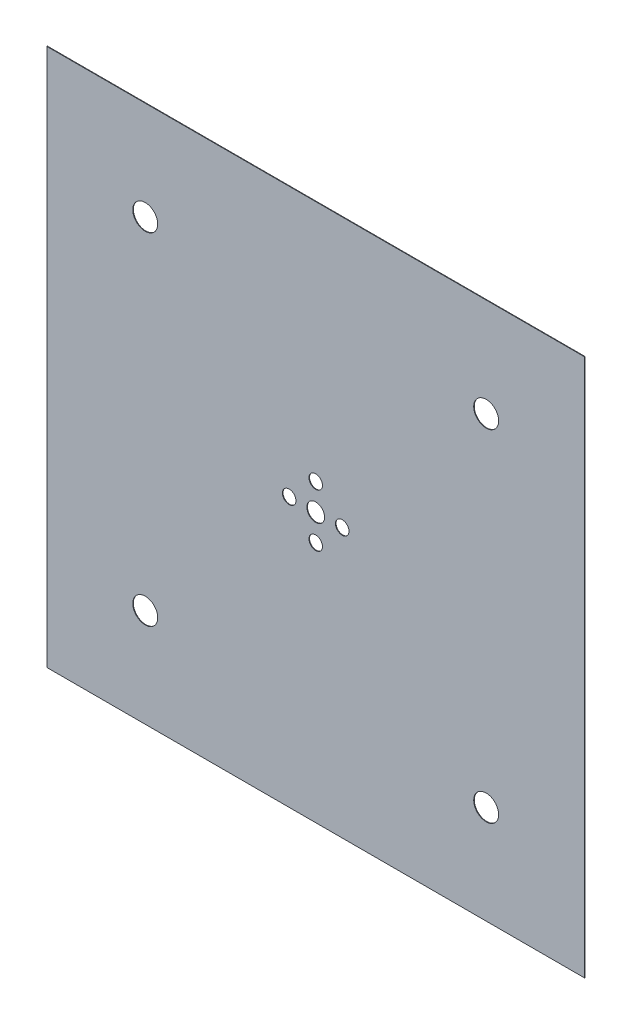
ISO-10303-21;
HEADER;
FILE_DESCRIPTION(('STEP AP214'),'2;1');
FILE_NAME('part.step','',(''),(''),'','','');
FILE_SCHEMA(('AUTOMOTIVE_DESIGN { 1 0 10303 214 1 1 1 1 }'));
ENDSEC;
DATA;
#1=APPLICATION_CONTEXT('core data for automotive mechanical design processes');
#2=APPLICATION_PROTOCOL_DEFINITION('international standard','automotive_design',2000,#1);
#3=PRODUCT_CONTEXT('',#1,'mechanical');
#4=PRODUCT('Part','Part','',(#3));
#5=PRODUCT_RELATED_PRODUCT_CATEGORY('part','',(#4));
#6=PRODUCT_DEFINITION_FORMATION('','',#4);
#7=PRODUCT_DEFINITION_CONTEXT('part definition',#1,'design');
#8=PRODUCT_DEFINITION('design','',#6,#7);
#9=PRODUCT_DEFINITION_SHAPE('','',#8);
#10=(LENGTH_UNIT() NAMED_UNIT(*) SI_UNIT(.MILLI.,.METRE.));
#11=(NAMED_UNIT(*) PLANE_ANGLE_UNIT() SI_UNIT($,.RADIAN.));
#12=(NAMED_UNIT(*) SI_UNIT($,.STERADIAN.) SOLID_ANGLE_UNIT());
#13=UNCERTAINTY_MEASURE_WITH_UNIT(LENGTH_MEASURE(1.E-05),#10,'distance_accuracy_value','');
#14=(GEOMETRIC_REPRESENTATION_CONTEXT(3) GLOBAL_UNCERTAINTY_ASSIGNED_CONTEXT((#13)) GLOBAL_UNIT_ASSIGNED_CONTEXT((#10,
#11,#12)) REPRESENTATION_CONTEXT('',''));
#15=CARTESIAN_POINT('',(0.,0.,0.));
#16=DIRECTION('',(0.,0.,1.));
#17=DIRECTION('',(1.,0.,0.));
#18=AXIS2_PLACEMENT_3D('',#15,#16,#17);
#19=CARTESIAN_POINT('',(0.,0.,3.));
#20=DIRECTION('',(0.,0.,1.));
#21=DIRECTION('',(1.,0.,0.));
#22=AXIS2_PLACEMENT_3D('',#19,#20,#21);
#23=PLANE('',#22);
#24=CARTESIAN_POINT('',(140.000000000001,-1.66533453693773E-12,3.));
#25=DIRECTION('',(0.,0.,1.));
#26=DIRECTION('',(1.,0.,0.));
#27=AXIS2_PLACEMENT_3D('',#24,#25,#26);
#28=CIRCLE('',#27,35.6374999999993);
#29=CARTESIAN_POINT('',(175.637500000001,-1.66533453693773E-12,3.));
#30=VERTEX_POINT('',#29);
#31=EDGE_CURVE('E157',#30,#30,#28,.T.);
#32=ORIENTED_EDGE('',*,*,#31,.F.);
#33=EDGE_LOOP('',(#32));
#34=FACE_BOUND('',#33,.T.);
#35=CARTESIAN_POINT('',(900.000000000001,900.,3.));
#36=DIRECTION('',(0.,0.,1.));
#37=DIRECTION('',(1.,0.,0.));
#38=AXIS2_PLACEMENT_3D('',#35,#36,#37);
#39=CIRCLE('',#38,65.8);
#40=CARTESIAN_POINT('',(965.800000000001,900.,3.));
#41=VERTEX_POINT('',#40);
#42=EDGE_CURVE('E145',#41,#41,#39,.T.);
#43=ORIENTED_EDGE('',*,*,#42,.F.);
#44=EDGE_LOOP('',(#43));
#45=FACE_BOUND('',#44,.T.);
#46=CARTESIAN_POINT('',(900.000000000001,-900.,3.));
#47=DIRECTION('',(0.,0.,1.));
#48=DIRECTION('',(-1.,0.,0.));
#49=AXIS2_PLACEMENT_3D('',#46,#47,#48);
#50=CIRCLE('',#49,65.8);
#51=CARTESIAN_POINT('',(834.200000000001,-900.,3.));
#52=VERTEX_POINT('',#51);
#53=EDGE_CURVE('E133',#52,#52,#50,.T.);
#54=ORIENTED_EDGE('',*,*,#53,.F.);
#55=EDGE_LOOP('',(#54));
#56=FACE_BOUND('',#55,.T.);
#57=CARTESIAN_POINT('',(1.56754790290861E-13,140.,3.));
#58=DIRECTION('',(0.,0.,1.));
#59=DIRECTION('',(1.,0.,0.));
#60=AXIS2_PLACEMENT_3D('',#57,#58,#59);
#61=CIRCLE('',#60,35.6375);
#62=CARTESIAN_POINT('',(35.6375000000002,140.,3.));
#63=VERTEX_POINT('',#62);
#64=EDGE_CURVE('E121',#63,#63,#61,.T.);
#65=ORIENTED_EDGE('',*,*,#64,.F.);
#66=EDGE_LOOP('',(#65));
#67=FACE_BOUND('',#66,.T.);
#68=DIRECTION('',(0.,1.,0.));
#69=VECTOR('',#68,1.);
#70=CARTESIAN_POINT('',(1420.,1420.,3.));
#71=LINE('',#70,#69);
#72=CARTESIAN_POINT('',(1420.,-1420.,3.));
#73=VERTEX_POINT('',#72);
#74=CARTESIAN_POINT('',(1420.,1420.,3.));
#75=VERTEX_POINT('',#74);
#76=EDGE_CURVE('E91',#73,#75,#71,.T.);
#77=ORIENTED_EDGE('',*,*,#76,.T.);
#78=DIRECTION('',(-1.,0.,0.));
#79=VECTOR('',#78,1.);
#80=CARTESIAN_POINT('',(-1420.,1420.,3.));
#81=LINE('',#80,#79);
#82=CARTESIAN_POINT('',(-1420.,1420.,3.));
#83=VERTEX_POINT('',#82);
#84=EDGE_CURVE('E86',#75,#83,#81,.T.);
#85=ORIENTED_EDGE('',*,*,#84,.T.);
#86=DIRECTION('',(0.,-1.,0.));
#87=VECTOR('',#86,1.);
#88=CARTESIAN_POINT('',(-1420.,1420.,3.));
#89=LINE('',#88,#87);
#90=CARTESIAN_POINT('',(-1420.,-1420.,3.));
#91=VERTEX_POINT('',#90);
#92=EDGE_CURVE('E89',#83,#91,#89,.T.);
#93=ORIENTED_EDGE('',*,*,#92,.T.);
#94=DIRECTION('',(1.,0.,0.));
#95=VECTOR('',#94,1.);
#96=CARTESIAN_POINT('',(-1420.,-1420.,3.));
#97=LINE('',#96,#95);
#98=EDGE_CURVE('E56',#91,#73,#97,.T.);
#99=ORIENTED_EDGE('',*,*,#98,.T.);
#100=EDGE_LOOP('',(#77,#85,#93,#99));
#101=FACE_BOUND('',#100,.T.);
#102=CARTESIAN_POINT('',(6.66133814775094E-13,-8.88178419700125E-13,3.));
#103=DIRECTION('',(0.,0.,1.));
#104=DIRECTION('',(1.,0.,0.));
#105=AXIS2_PLACEMENT_3D('',#102,#103,#104);
#106=CIRCLE('',#105,46.75);
#107=CARTESIAN_POINT('',(46.7500000000007,-8.88178419700125E-13,3.));
#108=VERTEX_POINT('',#107);
#109=EDGE_CURVE('E106',#108,#108,#106,.T.);
#110=ORIENTED_EDGE('',*,*,#109,.F.);
#111=EDGE_LOOP('',(#110));
#112=FACE_BOUND('',#111,.T.);
#113=CARTESIAN_POINT('',(-900.,900.,3.));
#114=DIRECTION('',(0.,0.,1.));
#115=DIRECTION('',(1.,0.,0.));
#116=AXIS2_PLACEMENT_3D('',#113,#114,#115);
#117=CIRCLE('',#116,65.8);
#118=CARTESIAN_POINT('',(-834.2,900.,3.));
#119=VERTEX_POINT('',#118);
#120=EDGE_CURVE('E127',#119,#119,#117,.T.);
#121=ORIENTED_EDGE('',*,*,#120,.F.);
#122=EDGE_LOOP('',(#121));
#123=FACE_BOUND('',#122,.T.);
#124=CARTESIAN_POINT('',(1.56754790290861E-13,-140.,3.));
#125=DIRECTION('',(0.,0.,1.));
#126=DIRECTION('',(-1.,0.,0.));
#127=AXIS2_PLACEMENT_3D('',#124,#125,#126);
#128=CIRCLE('',#127,35.6375);
#129=CARTESIAN_POINT('',(-35.6374999999998,-140.,3.));
#130=VERTEX_POINT('',#129);
#131=EDGE_CURVE('E139',#130,#130,#128,.T.);
#132=ORIENTED_EDGE('',*,*,#131,.F.);
#133=EDGE_LOOP('',(#132));
#134=FACE_BOUND('',#133,.T.);
#135=CARTESIAN_POINT('',(-900.,-900.000000000001,3.));
#136=DIRECTION('',(0.,0.,1.));
#137=DIRECTION('',(-1.,0.,0.));
#138=AXIS2_PLACEMENT_3D('',#135,#136,#137);
#139=CIRCLE('',#138,65.8);
#140=CARTESIAN_POINT('',(-965.8,-900.000000000001,3.));
#141=VERTEX_POINT('',#140);
#142=EDGE_CURVE('E151',#141,#141,#139,.T.);
#143=ORIENTED_EDGE('',*,*,#142,.F.);
#144=EDGE_LOOP('',(#143));
#145=FACE_BOUND('',#144,.T.);
#146=CARTESIAN_POINT('',(-140.,-9.99200722162641E-13,3.));
#147=DIRECTION('',(0.,0.,1.));
#148=DIRECTION('',(-1.,0.,0.));
#149=AXIS2_PLACEMENT_3D('',#146,#147,#148);
#150=CIRCLE('',#149,35.6375000000002);
#151=CARTESIAN_POINT('',(-175.6375,-9.99200722162641E-13,3.));
#152=VERTEX_POINT('',#151);
#153=EDGE_CURVE('E163',#152,#152,#150,.T.);
#154=ORIENTED_EDGE('',*,*,#153,.F.);
#155=EDGE_LOOP('',(#154));
#156=FACE_BOUND('',#155,.T.);
#157=ADVANCED_FACE('F39',(#34,#45,#56,#67,#101,#112,#123,#134,#145,#156),#23,.T.);
#158=CARTESIAN_POINT('',(0.,0.,0.));
#159=DIRECTION('',(0.,0.,1.));
#160=DIRECTION('',(1.,0.,0.));
#161=AXIS2_PLACEMENT_3D('',#158,#159,#160);
#162=PLANE('',#161);
#163=DIRECTION('',(0.,1.,0.));
#164=VECTOR('',#163,1.);
#165=CARTESIAN_POINT('',(1420.,1420.,0.));
#166=LINE('',#165,#164);
#167=CARTESIAN_POINT('',(1420.,-1420.,0.));
#168=VERTEX_POINT('',#167);
#169=CARTESIAN_POINT('',(1420.,1420.,0.));
#170=VERTEX_POINT('',#169);
#171=EDGE_CURVE('E103',#168,#170,#166,.T.);
#172=ORIENTED_EDGE('',*,*,#171,.F.);
#173=DIRECTION('',(1.,0.,0.));
#174=VECTOR('',#173,1.);
#175=CARTESIAN_POINT('',(-1420.,-1420.,0.));
#176=LINE('',#175,#174);
#177=CARTESIAN_POINT('',(-1420.,-1420.,0.));
#178=VERTEX_POINT('',#177);
#179=EDGE_CURVE('E79',#178,#168,#176,.T.);
#180=ORIENTED_EDGE('',*,*,#179,.F.);
#181=DIRECTION('',(0.,-1.,0.));
#182=VECTOR('',#181,1.);
#183=CARTESIAN_POINT('',(-1420.,1420.,0.));
#184=LINE('',#183,#182);
#185=CARTESIAN_POINT('',(-1420.,1420.,0.));
#186=VERTEX_POINT('',#185);
#187=EDGE_CURVE('E73',#186,#178,#184,.T.);
#188=ORIENTED_EDGE('',*,*,#187,.F.);
#189=DIRECTION('',(-1.,0.,0.));
#190=VECTOR('',#189,1.);
#191=CARTESIAN_POINT('',(-1420.,1420.,0.));
#192=LINE('',#191,#190);
#193=EDGE_CURVE('E95',#170,#186,#192,.T.);
#194=ORIENTED_EDGE('',*,*,#193,.F.);
#195=EDGE_LOOP('',(#172,#180,#188,#194));
#196=FACE_BOUND('',#195,.T.);
#197=CARTESIAN_POINT('',(6.66133814775094E-13,-8.88178419700125E-13,0.));
#198=DIRECTION('',(0.,0.,1.));
#199=DIRECTION('',(1.,0.,0.));
#200=AXIS2_PLACEMENT_3D('',#197,#198,#199);
#201=CIRCLE('',#200,46.75);
#202=CARTESIAN_POINT('',(46.7500000000007,-8.88178419700125E-13,0.));
#203=VERTEX_POINT('',#202);
#204=EDGE_CURVE('E118',#203,#203,#201,.T.);
#205=ORIENTED_EDGE('',*,*,#204,.T.);
#206=EDGE_LOOP('',(#205));
#207=FACE_BOUND('',#206,.T.);
#208=CARTESIAN_POINT('',(1.56754790290861E-13,140.,0.));
#209=DIRECTION('',(0.,0.,1.));
#210=DIRECTION('',(1.,0.,0.));
#211=AXIS2_PLACEMENT_3D('',#208,#209,#210);
#212=CIRCLE('',#211,35.6375);
#213=CARTESIAN_POINT('',(35.6375000000002,140.,0.));
#214=VERTEX_POINT('',#213);
#215=EDGE_CURVE('E124',#214,#214,#212,.T.);
#216=ORIENTED_EDGE('',*,*,#215,.T.);
#217=EDGE_LOOP('',(#216));
#218=FACE_BOUND('',#217,.T.);
#219=CARTESIAN_POINT('',(-900.,900.,0.));
#220=DIRECTION('',(0.,0.,1.));
#221=DIRECTION('',(1.,0.,0.));
#222=AXIS2_PLACEMENT_3D('',#219,#220,#221);
#223=CIRCLE('',#222,65.8);
#224=CARTESIAN_POINT('',(-834.2,900.,0.));
#225=VERTEX_POINT('',#224);
#226=EDGE_CURVE('E130',#225,#225,#223,.T.);
#227=ORIENTED_EDGE('',*,*,#226,.T.);
#228=EDGE_LOOP('',(#227));
#229=FACE_BOUND('',#228,.T.);
#230=CARTESIAN_POINT('',(900.000000000001,-900.,0.));
#231=DIRECTION('',(0.,0.,1.));
#232=DIRECTION('',(-1.,0.,0.));
#233=AXIS2_PLACEMENT_3D('',#230,#231,#232);
#234=CIRCLE('',#233,65.8);
#235=CARTESIAN_POINT('',(834.200000000001,-900.,0.));
#236=VERTEX_POINT('',#235);
#237=EDGE_CURVE('E136',#236,#236,#234,.T.);
#238=ORIENTED_EDGE('',*,*,#237,.T.);
#239=EDGE_LOOP('',(#238));
#240=FACE_BOUND('',#239,.T.);
#241=CARTESIAN_POINT('',(1.56754790290861E-13,-140.,0.));
#242=DIRECTION('',(0.,0.,1.));
#243=DIRECTION('',(-1.,0.,0.));
#244=AXIS2_PLACEMENT_3D('',#241,#242,#243);
#245=CIRCLE('',#244,35.6375);
#246=CARTESIAN_POINT('',(-35.6374999999998,-140.,0.));
#247=VERTEX_POINT('',#246);
#248=EDGE_CURVE('E142',#247,#247,#245,.T.);
#249=ORIENTED_EDGE('',*,*,#248,.T.);
#250=EDGE_LOOP('',(#249));
#251=FACE_BOUND('',#250,.T.);
#252=CARTESIAN_POINT('',(900.000000000001,900.,0.));
#253=DIRECTION('',(0.,0.,1.));
#254=DIRECTION('',(1.,0.,0.));
#255=AXIS2_PLACEMENT_3D('',#252,#253,#254);
#256=CIRCLE('',#255,65.8);
#257=CARTESIAN_POINT('',(965.800000000001,900.,0.));
#258=VERTEX_POINT('',#257);
#259=EDGE_CURVE('E148',#258,#258,#256,.T.);
#260=ORIENTED_EDGE('',*,*,#259,.T.);
#261=EDGE_LOOP('',(#260));
#262=FACE_BOUND('',#261,.T.);
#263=CARTESIAN_POINT('',(-900.,-900.000000000001,0.));
#264=DIRECTION('',(0.,0.,1.));
#265=DIRECTION('',(-1.,0.,0.));
#266=AXIS2_PLACEMENT_3D('',#263,#264,#265);
#267=CIRCLE('',#266,65.8);
#268=CARTESIAN_POINT('',(-965.8,-900.000000000001,0.));
#269=VERTEX_POINT('',#268);
#270=EDGE_CURVE('E154',#269,#269,#267,.T.);
#271=ORIENTED_EDGE('',*,*,#270,.T.);
#272=EDGE_LOOP('',(#271));
#273=FACE_BOUND('',#272,.T.);
#274=CARTESIAN_POINT('',(140.000000000001,-1.66533453693773E-12,0.));
#275=DIRECTION('',(0.,0.,1.));
#276=DIRECTION('',(1.,0.,0.));
#277=AXIS2_PLACEMENT_3D('',#274,#275,#276);
#278=CIRCLE('',#277,35.6374999999993);
#279=CARTESIAN_POINT('',(175.637500000001,-1.66533453693773E-12,0.));
#280=VERTEX_POINT('',#279);
#281=EDGE_CURVE('E160',#280,#280,#278,.T.);
#282=ORIENTED_EDGE('',*,*,#281,.T.);
#283=EDGE_LOOP('',(#282));
#284=FACE_BOUND('',#283,.T.);
#285=CARTESIAN_POINT('',(-140.,-9.99200722162641E-13,0.));
#286=DIRECTION('',(0.,0.,1.));
#287=DIRECTION('',(-1.,0.,0.));
#288=AXIS2_PLACEMENT_3D('',#285,#286,#287);
#289=CIRCLE('',#288,35.6375000000002);
#290=CARTESIAN_POINT('',(-175.6375,-9.99200722162641E-13,0.));
#291=VERTEX_POINT('',#290);
#292=EDGE_CURVE('E166',#291,#291,#289,.T.);
#293=ORIENTED_EDGE('',*,*,#292,.T.);
#294=EDGE_LOOP('',(#293));
#295=FACE_BOUND('',#294,.T.);
#296=ADVANCED_FACE('F114',(#196,#207,#218,#229,#240,#251,#262,#273,#284,#295),#162,.F.);
#297=CARTESIAN_POINT('',(1420.,1420.,3.));
#298=DIRECTION('',(-1.,0.,0.));
#299=DIRECTION('',(0.,-1.,0.));
#300=AXIS2_PLACEMENT_3D('',#297,#298,#299);
#301=PLANE('',#300);
#302=ORIENTED_EDGE('',*,*,#171,.T.);
#303=DIRECTION('',(0.,0.,-1.));
#304=VECTOR('',#303,1.);
#305=CARTESIAN_POINT('',(1420.,1420.,3.));
#306=LINE('',#305,#304);
#307=EDGE_CURVE('E11',#75,#170,#306,.T.);
#308=ORIENTED_EDGE('',*,*,#307,.F.);
#309=ORIENTED_EDGE('',*,*,#76,.F.);
#310=DIRECTION('',(0.,0.,-1.));
#311=VECTOR('',#310,1.);
#312=CARTESIAN_POINT('',(1420.,-1420.,3.));
#313=LINE('',#312,#311);
#314=EDGE_CURVE('E99',#73,#168,#313,.T.);
#315=ORIENTED_EDGE('',*,*,#314,.T.);
#316=EDGE_LOOP('',(#302,#308,#309,#315));
#317=FACE_BOUND('',#316,.T.);
#318=ADVANCED_FACE('F41',(#317),#301,.F.);
#319=CARTESIAN_POINT('',(-1420.,1420.,3.));
#320=DIRECTION('',(0.,-1.,0.));
#321=DIRECTION('',(0.,0.,-1.));
#322=AXIS2_PLACEMENT_3D('',#319,#320,#321);
#323=PLANE('',#322);
#324=ORIENTED_EDGE('',*,*,#193,.T.);
#325=DIRECTION('',(0.,0.,-1.));
#326=VECTOR('',#325,1.);
#327=CARTESIAN_POINT('',(-1420.,1420.,3.));
#328=LINE('',#327,#326);
#329=EDGE_CURVE('E48',#83,#186,#328,.T.);
#330=ORIENTED_EDGE('',*,*,#329,.F.);
#331=ORIENTED_EDGE('',*,*,#84,.F.);
#332=ORIENTED_EDGE('',*,*,#307,.T.);
#333=EDGE_LOOP('',(#324,#330,#331,#332));
#334=FACE_BOUND('',#333,.T.);
#335=ADVANCED_FACE('F94',(#334),#323,.F.);
#336=CARTESIAN_POINT('',(-1420.,1420.,3.));
#337=DIRECTION('',(1.,0.,0.));
#338=DIRECTION('',(0.,1.,0.));
#339=AXIS2_PLACEMENT_3D('',#336,#337,#338);
#340=PLANE('',#339);
#341=ORIENTED_EDGE('',*,*,#187,.T.);
#342=DIRECTION('',(0.,0.,-1.));
#343=VECTOR('',#342,1.);
#344=CARTESIAN_POINT('',(-1420.,-1420.,3.));
#345=LINE('',#344,#343);
#346=EDGE_CURVE('E96',#91,#178,#345,.T.);
#347=ORIENTED_EDGE('',*,*,#346,.F.);
#348=ORIENTED_EDGE('',*,*,#92,.F.);
#349=ORIENTED_EDGE('',*,*,#329,.T.);
#350=EDGE_LOOP('',(#341,#347,#348,#349));
#351=FACE_BOUND('',#350,.T.);
#352=ADVANCED_FACE('F97',(#351),#340,.F.);
#353=CARTESIAN_POINT('',(-1420.,-1420.,3.));
#354=DIRECTION('',(0.,1.,0.));
#355=DIRECTION('',(0.,0.,1.));
#356=AXIS2_PLACEMENT_3D('',#353,#354,#355);
#357=PLANE('',#356);
#358=ORIENTED_EDGE('',*,*,#179,.T.);
#359=ORIENTED_EDGE('',*,*,#314,.F.);
#360=ORIENTED_EDGE('',*,*,#98,.F.);
#361=ORIENTED_EDGE('',*,*,#346,.T.);
#362=EDGE_LOOP('',(#358,#359,#360,#361));
#363=FACE_BOUND('',#362,.T.);
#364=ADVANCED_FACE('F111',(#363),#357,.F.);
#365=CARTESIAN_POINT('',(6.66133814775094E-13,-8.88178419700125E-13,3.));
#366=DIRECTION('',(0.,0.,-1.));
#367=DIRECTION('',(-1.,0.,0.));
#368=AXIS2_PLACEMENT_3D('',#365,#366,#367);
#369=CYLINDRICAL_SURFACE('',#368,46.75);
#370=ORIENTED_EDGE('',*,*,#109,.T.);
#371=EDGE_LOOP('',(#370));
#372=FACE_BOUND('',#371,.T.);
#373=ORIENTED_EDGE('',*,*,#204,.F.);
#374=EDGE_LOOP('',(#373));
#375=FACE_BOUND('',#374,.T.);
#376=ADVANCED_FACE('F185',(#372,#375),#369,.F.);
#377=CARTESIAN_POINT('',(1.56754790290861E-13,140.,3.));
#378=DIRECTION('',(0.,0.,-1.));
#379=DIRECTION('',(-1.,0.,0.));
#380=AXIS2_PLACEMENT_3D('',#377,#378,#379);
#381=CYLINDRICAL_SURFACE('',#380,35.6375);
#382=ORIENTED_EDGE('',*,*,#64,.T.);
#383=EDGE_LOOP('',(#382));
#384=FACE_BOUND('',#383,.T.);
#385=ORIENTED_EDGE('',*,*,#215,.F.);
#386=EDGE_LOOP('',(#385));
#387=FACE_BOUND('',#386,.T.);
#388=ADVANCED_FACE('F239',(#384,#387),#381,.F.);
#389=CARTESIAN_POINT('',(-900.,900.,3.));
#390=DIRECTION('',(0.,0.,-1.));
#391=DIRECTION('',(-1.,0.,0.));
#392=AXIS2_PLACEMENT_3D('',#389,#390,#391);
#393=CYLINDRICAL_SURFACE('',#392,65.8);
#394=ORIENTED_EDGE('',*,*,#120,.T.);
#395=EDGE_LOOP('',(#394));
#396=FACE_BOUND('',#395,.T.);
#397=ORIENTED_EDGE('',*,*,#226,.F.);
#398=EDGE_LOOP('',(#397));
#399=FACE_BOUND('',#398,.T.);
#400=ADVANCED_FACE('F248',(#396,#399),#393,.F.);
#401=CARTESIAN_POINT('',(900.000000000001,-900.,3.));
#402=DIRECTION('',(0.,0.,-1.));
#403=DIRECTION('',(-1.,0.,0.));
#404=AXIS2_PLACEMENT_3D('',#401,#402,#403);
#405=CYLINDRICAL_SURFACE('',#404,65.8);
#406=ORIENTED_EDGE('',*,*,#53,.T.);
#407=EDGE_LOOP('',(#406));
#408=FACE_BOUND('',#407,.T.);
#409=ORIENTED_EDGE('',*,*,#237,.F.);
#410=EDGE_LOOP('',(#409));
#411=FACE_BOUND('',#410,.T.);
#412=ADVANCED_FACE('F257',(#408,#411),#405,.F.);
#413=CARTESIAN_POINT('',(1.56754790290861E-13,-140.,3.));
#414=DIRECTION('',(0.,0.,-1.));
#415=DIRECTION('',(-1.,0.,0.));
#416=AXIS2_PLACEMENT_3D('',#413,#414,#415);
#417=CYLINDRICAL_SURFACE('',#416,35.6375);
#418=ORIENTED_EDGE('',*,*,#131,.T.);
#419=EDGE_LOOP('',(#418));
#420=FACE_BOUND('',#419,.T.);
#421=ORIENTED_EDGE('',*,*,#248,.F.);
#422=EDGE_LOOP('',(#421));
#423=FACE_BOUND('',#422,.T.);
#424=ADVANCED_FACE('F267',(#420,#423),#417,.F.);
#425=CARTESIAN_POINT('',(900.000000000001,900.,3.));
#426=DIRECTION('',(0.,0.,-1.));
#427=DIRECTION('',(-1.,0.,0.));
#428=AXIS2_PLACEMENT_3D('',#425,#426,#427);
#429=CYLINDRICAL_SURFACE('',#428,65.8);
#430=ORIENTED_EDGE('',*,*,#42,.T.);
#431=EDGE_LOOP('',(#430));
#432=FACE_BOUND('',#431,.T.);
#433=ORIENTED_EDGE('',*,*,#259,.F.);
#434=EDGE_LOOP('',(#433));
#435=FACE_BOUND('',#434,.T.);
#436=ADVANCED_FACE('F277',(#432,#435),#429,.F.);
#437=CARTESIAN_POINT('',(-900.,-900.000000000001,3.));
#438=DIRECTION('',(0.,0.,-1.));
#439=DIRECTION('',(-1.,0.,0.));
#440=AXIS2_PLACEMENT_3D('',#437,#438,#439);
#441=CYLINDRICAL_SURFACE('',#440,65.8);
#442=ORIENTED_EDGE('',*,*,#142,.T.);
#443=EDGE_LOOP('',(#442));
#444=FACE_BOUND('',#443,.T.);
#445=ORIENTED_EDGE('',*,*,#270,.F.);
#446=EDGE_LOOP('',(#445));
#447=FACE_BOUND('',#446,.T.);
#448=ADVANCED_FACE('F287',(#444,#447),#441,.F.);
#449=CARTESIAN_POINT('',(140.000000000001,-1.66533453693773E-12,3.));
#450=DIRECTION('',(0.,0.,-1.));
#451=DIRECTION('',(-1.,0.,0.));
#452=AXIS2_PLACEMENT_3D('',#449,#450,#451);
#453=CYLINDRICAL_SURFACE('',#452,35.6374999999993);
#454=ORIENTED_EDGE('',*,*,#31,.T.);
#455=EDGE_LOOP('',(#454));
#456=FACE_BOUND('',#455,.T.);
#457=ORIENTED_EDGE('',*,*,#281,.F.);
#458=EDGE_LOOP('',(#457));
#459=FACE_BOUND('',#458,.T.);
#460=ADVANCED_FACE('F297',(#456,#459),#453,.F.);
#461=CARTESIAN_POINT('',(-140.,-9.99200722162641E-13,3.));
#462=DIRECTION('',(0.,0.,-1.));
#463=DIRECTION('',(-1.,0.,0.));
#464=AXIS2_PLACEMENT_3D('',#461,#462,#463);
#465=CYLINDRICAL_SURFACE('',#464,35.6375000000002);
#466=ORIENTED_EDGE('',*,*,#153,.T.);
#467=EDGE_LOOP('',(#466));
#468=FACE_BOUND('',#467,.T.);
#469=ORIENTED_EDGE('',*,*,#292,.F.);
#470=EDGE_LOOP('',(#469));
#471=FACE_BOUND('',#470,.T.);
#472=ADVANCED_FACE('F172',(#468,#471),#465,.F.);
#473=CLOSED_SHELL('',(#157,#296,#318,#335,#352,#364,#376,#388,#400,#412,#424,#436,#448,#460,#472));
#474=MANIFOLD_SOLID_BREP('B2',#473);
#475=ADVANCED_BREP_SHAPE_REPRESENTATION('',(#18,#474),#14);
#476=SHAPE_DEFINITION_REPRESENTATION(#9,#475);
ENDSEC;
END-ISO-10303-21;
